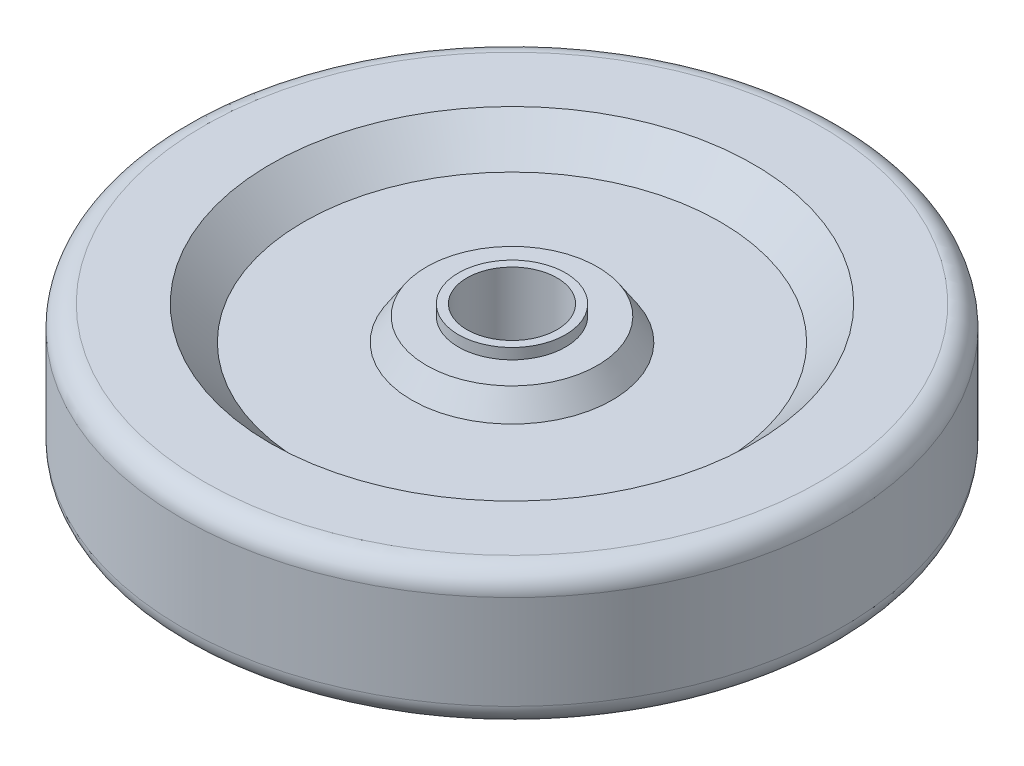
ISO-10303-21;
HEADER;
FILE_DESCRIPTION(('STEP AP214'),'2;1');
FILE_NAME('part.step','',(''),(''),'','','');
FILE_SCHEMA(('AUTOMOTIVE_DESIGN { 1 0 10303 214 1 1 1 1 }'));
ENDSEC;
DATA;
#1=APPLICATION_CONTEXT('core data for automotive mechanical design processes');
#2=APPLICATION_PROTOCOL_DEFINITION('international standard','automotive_design',2000,#1);
#3=PRODUCT_CONTEXT('',#1,'mechanical');
#4=PRODUCT('Part','Part','',(#3));
#5=PRODUCT_RELATED_PRODUCT_CATEGORY('part','',(#4));
#6=PRODUCT_DEFINITION_FORMATION('','',#4);
#7=PRODUCT_DEFINITION_CONTEXT('part definition',#1,'design');
#8=PRODUCT_DEFINITION('design','',#6,#7);
#9=PRODUCT_DEFINITION_SHAPE('','',#8);
#10=(LENGTH_UNIT() NAMED_UNIT(*) SI_UNIT(.MILLI.,.METRE.));
#11=(NAMED_UNIT(*) PLANE_ANGLE_UNIT() SI_UNIT($,.RADIAN.));
#12=(NAMED_UNIT(*) SI_UNIT($,.STERADIAN.) SOLID_ANGLE_UNIT());
#13=UNCERTAINTY_MEASURE_WITH_UNIT(LENGTH_MEASURE(1.E-05),#10,'distance_accuracy_value','');
#14=(GEOMETRIC_REPRESENTATION_CONTEXT(3) GLOBAL_UNCERTAINTY_ASSIGNED_CONTEXT((#13)) GLOBAL_UNIT_ASSIGNED_CONTEXT((#10,
#11,#12)) REPRESENTATION_CONTEXT('',''));
#15=CARTESIAN_POINT('',(0.,0.,0.));
#16=DIRECTION('',(0.,0.,1.));
#17=DIRECTION('',(1.,0.,0.));
#18=AXIS2_PLACEMENT_3D('',#15,#16,#17);
#19=CARTESIAN_POINT('',(0.,0.,-12.5));
#20=DIRECTION('',(0.,1.,0.));
#21=DIRECTION('',(0.,0.,1.));
#22=AXIS2_PLACEMENT_3D('',#19,#20,#21);
#23=PLANE('',#22);
#24=CARTESIAN_POINT('',(0.,0.,0.));
#25=DIRECTION('',(0.,1.,0.));
#26=DIRECTION('',(0.,0.,1.));
#27=AXIS2_PLACEMENT_3D('',#24,#25,#26);
#28=CIRCLE('',#27,12.5);
#29=CARTESIAN_POINT('',(0.,0.,12.5));
#30=VERTEX_POINT('',#29);
#31=EDGE_CURVE('E92',#30,#30,#28,.T.);
#32=ORIENTED_EDGE('',*,*,#31,.F.);
#33=EDGE_LOOP('',(#32));
#34=FACE_BOUND('',#33,.T.);
#35=CARTESIAN_POINT('',(0.,0.,0.));
#36=DIRECTION('',(0.,1.,0.));
#37=DIRECTION('',(0.,0.,1.));
#38=AXIS2_PLACEMENT_3D('',#35,#36,#37);
#39=CIRCLE('',#38,10.5);
#40=CARTESIAN_POINT('',(0.,0.,10.5));
#41=VERTEX_POINT('',#40);
#42=EDGE_CURVE('E10',#41,#41,#39,.T.);
#43=ORIENTED_EDGE('',*,*,#42,.T.);
#44=EDGE_LOOP('',(#43));
#45=FACE_BOUND('',#44,.T.);
#46=ADVANCED_FACE('F34',(#34,#45),#23,.F.);
#47=CARTESIAN_POINT('',(0.,76.5841864465714,0.));
#48=DIRECTION('',(0.,1.,0.));
#49=DIRECTION('',(0.,0.,1.));
#50=AXIS2_PLACEMENT_3D('',#47,#48,#49);
#51=CYLINDRICAL_SURFACE('',#50,10.5);
#52=ORIENTED_EDGE('',*,*,#42,.F.);
#53=EDGE_LOOP('',(#52));
#54=FACE_BOUND('',#53,.T.);
#55=CARTESIAN_POINT('',(0.,32.,0.));
#56=DIRECTION('',(0.,1.,0.));
#57=DIRECTION('',(0.,0.,1.));
#58=AXIS2_PLACEMENT_3D('',#55,#56,#57);
#59=CIRCLE('',#58,10.5);
#60=CARTESIAN_POINT('',(0.,32.,10.5));
#61=VERTEX_POINT('',#60);
#62=EDGE_CURVE('E40',#61,#61,#59,.T.);
#63=ORIENTED_EDGE('',*,*,#62,.T.);
#64=EDGE_LOOP('',(#63));
#65=FACE_BOUND('',#64,.T.);
#66=ADVANCED_FACE('F99',(#54,#65),#51,.F.);
#67=CARTESIAN_POINT('',(0.,32.,-10.5));
#68=DIRECTION('',(0.,-1.,0.));
#69=DIRECTION('',(0.,0.,-1.));
#70=AXIS2_PLACEMENT_3D('',#67,#68,#69);
#71=PLANE('',#70);
#72=ORIENTED_EDGE('',*,*,#62,.F.);
#73=EDGE_LOOP('',(#72));
#74=FACE_BOUND('',#73,.T.);
#75=CARTESIAN_POINT('',(0.,32.,0.));
#76=DIRECTION('',(0.,1.,0.));
#77=DIRECTION('',(0.,0.,1.));
#78=AXIS2_PLACEMENT_3D('',#75,#76,#77);
#79=CIRCLE('',#78,12.5);
#80=CARTESIAN_POINT('',(0.,32.,12.5));
#81=VERTEX_POINT('',#80);
#82=EDGE_CURVE('E44',#81,#81,#79,.T.);
#83=ORIENTED_EDGE('',*,*,#82,.T.);
#84=EDGE_LOOP('',(#83));
#85=FACE_BOUND('',#84,.T.);
#86=ADVANCED_FACE('F103',(#74,#85),#71,.F.);
#87=CARTESIAN_POINT('',(0.,76.5841864465714,0.));
#88=DIRECTION('',(0.,1.,0.));
#89=DIRECTION('',(0.,0.,1.));
#90=AXIS2_PLACEMENT_3D('',#87,#88,#89);
#91=CYLINDRICAL_SURFACE('',#90,12.5);
#92=ORIENTED_EDGE('',*,*,#82,.F.);
#93=EDGE_LOOP('',(#92));
#94=FACE_BOUND('',#93,.T.);
#95=CARTESIAN_POINT('',(0.,29.5,0.));
#96=DIRECTION('',(0.,1.,0.));
#97=DIRECTION('',(0.,0.,1.));
#98=AXIS2_PLACEMENT_3D('',#95,#96,#97);
#99=CIRCLE('',#98,12.5);
#100=CARTESIAN_POINT('',(0.,29.5,12.5));
#101=VERTEX_POINT('',#100);
#102=EDGE_CURVE('E48',#101,#101,#99,.T.);
#103=ORIENTED_EDGE('',*,*,#102,.T.);
#104=EDGE_LOOP('',(#103));
#105=FACE_BOUND('',#104,.T.);
#106=ADVANCED_FACE('F108',(#94,#105),#91,.T.);
#107=CARTESIAN_POINT('',(0.,29.5,-12.5));
#108=DIRECTION('',(0.,-1.,0.));
#109=DIRECTION('',(0.,0.,-1.));
#110=AXIS2_PLACEMENT_3D('',#107,#108,#109);
#111=PLANE('',#110);
#112=ORIENTED_EDGE('',*,*,#102,.F.);
#113=EDGE_LOOP('',(#112));
#114=FACE_BOUND('',#113,.T.);
#115=CARTESIAN_POINT('',(0.,29.5,0.));
#116=DIRECTION('',(0.,1.,0.));
#117=DIRECTION('',(0.,0.,1.));
#118=AXIS2_PLACEMENT_3D('',#115,#116,#117);
#119=CIRCLE('',#118,19.9443443288264);
#120=CARTESIAN_POINT('',(0.,29.5,19.9443443288264));
#121=VERTEX_POINT('',#120);
#122=EDGE_CURVE('E53',#121,#121,#119,.T.);
#123=ORIENTED_EDGE('',*,*,#122,.T.);
#124=EDGE_LOOP('',(#123));
#125=FACE_BOUND('',#124,.T.);
#126=ADVANCED_FACE('F114',(#114,#125),#111,.F.);
#127=CARTESIAN_POINT('',(0.,24.236876385354,0.));
#128=DIRECTION('',(0.,-1.,0.));
#129=DIRECTION('',(0.,0.,-1.));
#130=AXIS2_PLACEMENT_3D('',#127,#128,#129);
#131=CONICAL_SURFACE('',#130,23.412925951231,0.58270037698044);
#132=ORIENTED_EDGE('',*,*,#122,.F.);
#133=EDGE_LOOP('',(#132));
#134=FACE_BOUND('',#133,.T.);
#135=CARTESIAN_POINT('',(0.,24.236876385354,0.));
#136=DIRECTION('',(0.,1.,0.));
#137=DIRECTION('',(0.,0.,1.));
#138=AXIS2_PLACEMENT_3D('',#135,#136,#137);
#139=CIRCLE('',#138,23.412925951231);
#140=CARTESIAN_POINT('',(0.,24.236876385354,23.412925951231));
#141=VERTEX_POINT('',#140);
#142=EDGE_CURVE('E56',#141,#141,#139,.T.);
#143=ORIENTED_EDGE('',*,*,#142,.T.);
#144=EDGE_LOOP('',(#143));
#145=FACE_BOUND('',#144,.T.);
#146=ADVANCED_FACE('F118',(#134,#145),#131,.T.);
#147=CARTESIAN_POINT('',(0.,24.236876385354,-23.412925951231));
#148=DIRECTION('',(0.,-1.,0.));
#149=DIRECTION('',(0.,0.,-1.));
#150=AXIS2_PLACEMENT_3D('',#147,#148,#149);
#151=PLANE('',#150);
#152=ORIENTED_EDGE('',*,*,#142,.F.);
#153=EDGE_LOOP('',(#152));
#154=FACE_BOUND('',#153,.T.);
#155=CARTESIAN_POINT('',(0.,24.236876385354,0.));
#156=DIRECTION('',(0.,1.,0.));
#157=DIRECTION('',(0.,0.,1.));
#158=AXIS2_PLACEMENT_3D('',#155,#156,#157);
#159=CIRCLE('',#158,48.6268462064028);
#160=CARTESIAN_POINT('',(0.,24.236876385354,48.6268462064028));
#161=VERTEX_POINT('',#160);
#162=EDGE_CURVE('E59',#161,#161,#159,.T.);
#163=ORIENTED_EDGE('',*,*,#162,.T.);
#164=EDGE_LOOP('',(#163));
#165=FACE_BOUND('',#164,.T.);
#166=ADVANCED_FACE('F122',(#154,#165),#151,.F.);
#167=CARTESIAN_POINT('',(0.,32.,0.));
#168=DIRECTION('',(0.,1.,0.));
#169=DIRECTION('',(0.,0.,1.));
#170=AXIS2_PLACEMENT_3D('',#167,#168,#169);
#171=CONICAL_SURFACE('',#170,56.3899698210487,0.785398163397447);
#172=ORIENTED_EDGE('',*,*,#162,.F.);
#173=EDGE_LOOP('',(#172));
#174=FACE_BOUND('',#173,.T.);
#175=CARTESIAN_POINT('',(0.,32.,0.));
#176=DIRECTION('',(0.,1.,0.));
#177=DIRECTION('',(0.,0.,1.));
#178=AXIS2_PLACEMENT_3D('',#175,#176,#177);
#179=CIRCLE('',#178,56.3899698210487);
#180=CARTESIAN_POINT('',(0.,32.,56.3899698210487));
#181=VERTEX_POINT('',#180);
#182=EDGE_CURVE('E62',#181,#181,#179,.T.);
#183=ORIENTED_EDGE('',*,*,#182,.T.);
#184=EDGE_LOOP('',(#183));
#185=FACE_BOUND('',#184,.T.);
#186=ADVANCED_FACE('F126',(#174,#185),#171,.F.);
#187=CARTESIAN_POINT('',(0.,32.,-56.3899698210487));
#188=DIRECTION('',(0.,-1.,0.));
#189=DIRECTION('',(0.,0.,-1.));
#190=AXIS2_PLACEMENT_3D('',#187,#188,#189);
#191=PLANE('',#190);
#192=ORIENTED_EDGE('',*,*,#182,.F.);
#193=EDGE_LOOP('',(#192));
#194=FACE_BOUND('',#193,.T.);
#195=CARTESIAN_POINT('',(0.,32.,0.));
#196=DIRECTION('',(0.,1.,0.));
#197=DIRECTION('',(0.,0.,1.));
#198=AXIS2_PLACEMENT_3D('',#195,#196,#197);
#199=CIRCLE('',#198,71.9091271275478);
#200=CARTESIAN_POINT('',(0.,32.,71.9091271275478));
#201=VERTEX_POINT('',#200);
#202=EDGE_CURVE('E65',#201,#201,#199,.T.);
#203=ORIENTED_EDGE('',*,*,#202,.T.);
#204=EDGE_LOOP('',(#203));
#205=FACE_BOUND('',#204,.T.);
#206=ADVANCED_FACE('F130',(#194,#205),#191,.F.);
#207=CARTESIAN_POINT('',(0.,27.,0.));
#208=DIRECTION('',(0.,1.,0.));
#209=DIRECTION('',(0.,0.,1.));
#210=AXIS2_PLACEMENT_3D('',#207,#208,#209);
#211=TOROIDAL_SURFACE('',#210,71.9091271275478,5.);
#212=ORIENTED_EDGE('',*,*,#202,.F.);
#213=EDGE_LOOP('',(#212));
#214=FACE_BOUND('',#213,.T.);
#215=CARTESIAN_POINT('',(0.,27.,0.));
#216=DIRECTION('',(0.,1.,0.));
#217=DIRECTION('',(0.,0.,1.));
#218=AXIS2_PLACEMENT_3D('',#215,#216,#217);
#219=CIRCLE('',#218,76.9091271275479);
#220=CARTESIAN_POINT('',(0.,27.,76.9091271275479));
#221=VERTEX_POINT('',#220);
#222=EDGE_CURVE('E68',#221,#221,#219,.T.);
#223=ORIENTED_EDGE('',*,*,#222,.T.);
#224=EDGE_LOOP('',(#223));
#225=FACE_BOUND('',#224,.T.);
#226=ADVANCED_FACE('F134',(#214,#225),#211,.T.);
#227=CARTESIAN_POINT('',(0.,76.5841864465714,0.));
#228=DIRECTION('',(0.,1.,0.));
#229=DIRECTION('',(0.,0.,1.));
#230=AXIS2_PLACEMENT_3D('',#227,#228,#229);
#231=CYLINDRICAL_SURFACE('',#230,76.9091271275479);
#232=ORIENTED_EDGE('',*,*,#222,.F.);
#233=EDGE_LOOP('',(#232));
#234=FACE_BOUND('',#233,.T.);
#235=CARTESIAN_POINT('',(0.,5.00000000000003,0.));
#236=DIRECTION('',(0.,1.,0.));
#237=DIRECTION('',(0.,0.,1.));
#238=AXIS2_PLACEMENT_3D('',#235,#236,#237);
#239=CIRCLE('',#238,76.9091271275479);
#240=CARTESIAN_POINT('',(0.,5.00000000000003,76.9091271275479));
#241=VERTEX_POINT('',#240);
#242=EDGE_CURVE('E71',#241,#241,#239,.T.);
#243=ORIENTED_EDGE('',*,*,#242,.T.);
#244=EDGE_LOOP('',(#243));
#245=FACE_BOUND('',#244,.T.);
#246=ADVANCED_FACE('F138',(#234,#245),#231,.T.);
#247=CARTESIAN_POINT('',(0.,5.,0.));
#248=DIRECTION('',(0.,1.,0.));
#249=DIRECTION('',(0.,0.,1.));
#250=AXIS2_PLACEMENT_3D('',#247,#248,#249);
#251=TOROIDAL_SURFACE('',#250,71.9091271275478,5.);
#252=ORIENTED_EDGE('',*,*,#242,.F.);
#253=EDGE_LOOP('',(#252));
#254=FACE_BOUND('',#253,.T.);
#255=CARTESIAN_POINT('',(0.,0.,0.));
#256=DIRECTION('',(0.,1.,0.));
#257=DIRECTION('',(0.,0.,1.));
#258=AXIS2_PLACEMENT_3D('',#255,#256,#257);
#259=CIRCLE('',#258,71.9091271275478);
#260=CARTESIAN_POINT('',(0.,0.,71.9091271275478));
#261=VERTEX_POINT('',#260);
#262=EDGE_CURVE('E74',#261,#261,#259,.T.);
#263=ORIENTED_EDGE('',*,*,#262,.T.);
#264=EDGE_LOOP('',(#263));
#265=FACE_BOUND('',#264,.T.);
#266=ADVANCED_FACE('F142',(#254,#265),#251,.T.);
#267=CARTESIAN_POINT('',(0.,0.,-71.9091271275478));
#268=DIRECTION('',(0.,1.,0.));
#269=DIRECTION('',(0.,0.,1.));
#270=AXIS2_PLACEMENT_3D('',#267,#268,#269);
#271=PLANE('',#270);
#272=ORIENTED_EDGE('',*,*,#262,.F.);
#273=EDGE_LOOP('',(#272));
#274=FACE_BOUND('',#273,.T.);
#275=CARTESIAN_POINT('',(0.,0.,0.));
#276=DIRECTION('',(0.,1.,0.));
#277=DIRECTION('',(0.,0.,1.));
#278=AXIS2_PLACEMENT_3D('',#275,#276,#277);
#279=CIRCLE('',#278,56.3899698210487);
#280=CARTESIAN_POINT('',(0.,0.,56.3899698210487));
#281=VERTEX_POINT('',#280);
#282=EDGE_CURVE('E77',#281,#281,#279,.T.);
#283=ORIENTED_EDGE('',*,*,#282,.T.);
#284=EDGE_LOOP('',(#283));
#285=FACE_BOUND('',#284,.T.);
#286=ADVANCED_FACE('F146',(#274,#285),#271,.F.);
#287=CARTESIAN_POINT('',(0.,5.96858162240457,0.));
#288=DIRECTION('',(0.,-1.,0.));
#289=DIRECTION('',(0.,0.,-1.));
#290=AXIS2_PLACEMENT_3D('',#287,#288,#289);
#291=CONICAL_SURFACE('',#290,48.6438219933432,0.91428963850186);
#292=ORIENTED_EDGE('',*,*,#282,.F.);
#293=EDGE_LOOP('',(#292));
#294=FACE_BOUND('',#293,.T.);
#295=CARTESIAN_POINT('',(0.,5.96858162240457,0.));
#296=DIRECTION('',(0.,1.,0.));
#297=DIRECTION('',(0.,0.,1.));
#298=AXIS2_PLACEMENT_3D('',#295,#296,#297);
#299=CIRCLE('',#298,48.6438219933432);
#300=CARTESIAN_POINT('',(0.,5.96858162240457,48.6438219933432));
#301=VERTEX_POINT('',#300);
#302=EDGE_CURVE('E80',#301,#301,#299,.T.);
#303=ORIENTED_EDGE('',*,*,#302,.T.);
#304=EDGE_LOOP('',(#303));
#305=FACE_BOUND('',#304,.T.);
#306=ADVANCED_FACE('F150',(#294,#305),#291,.F.);
#307=CARTESIAN_POINT('',(0.,5.96858162240458,-23.412925951231));
#308=DIRECTION('',(0.,1.,0.));
#309=DIRECTION('',(0.,0.,1.));
#310=AXIS2_PLACEMENT_3D('',#307,#308,#309);
#311=PLANE('',#310);
#312=ORIENTED_EDGE('',*,*,#302,.F.);
#313=EDGE_LOOP('',(#312));
#314=FACE_BOUND('',#313,.T.);
#315=CARTESIAN_POINT('',(0.,5.96858162240459,0.));
#316=DIRECTION('',(0.,1.,0.));
#317=DIRECTION('',(0.,0.,1.));
#318=AXIS2_PLACEMENT_3D('',#315,#316,#317);
#319=CIRCLE('',#318,23.412925951231);
#320=CARTESIAN_POINT('',(0.,5.96858162240459,23.412925951231));
#321=VERTEX_POINT('',#320);
#322=EDGE_CURVE('E83',#321,#321,#319,.T.);
#323=ORIENTED_EDGE('',*,*,#322,.T.);
#324=EDGE_LOOP('',(#323));
#325=FACE_BOUND('',#324,.T.);
#326=ADVANCED_FACE('F154',(#314,#325),#311,.F.);
#327=CARTESIAN_POINT('',(0.,2.5,0.));
#328=DIRECTION('',(0.,1.,0.));
#329=DIRECTION('',(0.,0.,1.));
#330=AXIS2_PLACEMENT_3D('',#327,#328,#329);
#331=CONICAL_SURFACE('',#330,19.9443443288264,0.785398163397446);
#332=ORIENTED_EDGE('',*,*,#322,.F.);
#333=EDGE_LOOP('',(#332));
#334=FACE_BOUND('',#333,.T.);
#335=CARTESIAN_POINT('',(0.,2.5,0.));
#336=DIRECTION('',(0.,1.,0.));
#337=DIRECTION('',(0.,0.,1.));
#338=AXIS2_PLACEMENT_3D('',#335,#336,#337);
#339=CIRCLE('',#338,19.9443443288264);
#340=CARTESIAN_POINT('',(0.,2.5,19.9443443288264));
#341=VERTEX_POINT('',#340);
#342=EDGE_CURVE('E86',#341,#341,#339,.T.);
#343=ORIENTED_EDGE('',*,*,#342,.T.);
#344=EDGE_LOOP('',(#343));
#345=FACE_BOUND('',#344,.T.);
#346=ADVANCED_FACE('F158',(#334,#345),#331,.T.);
#347=CARTESIAN_POINT('',(0.,2.5,-12.5));
#348=DIRECTION('',(0.,1.,0.));
#349=DIRECTION('',(0.,0.,1.));
#350=AXIS2_PLACEMENT_3D('',#347,#348,#349);
#351=PLANE('',#350);
#352=ORIENTED_EDGE('',*,*,#342,.F.);
#353=EDGE_LOOP('',(#352));
#354=FACE_BOUND('',#353,.T.);
#355=CARTESIAN_POINT('',(0.,2.5,0.));
#356=DIRECTION('',(0.,1.,0.));
#357=DIRECTION('',(0.,0.,1.));
#358=AXIS2_PLACEMENT_3D('',#355,#356,#357);
#359=CIRCLE('',#358,12.5);
#360=CARTESIAN_POINT('',(0.,2.5,12.5));
#361=VERTEX_POINT('',#360);
#362=EDGE_CURVE('E89',#361,#361,#359,.T.);
#363=ORIENTED_EDGE('',*,*,#362,.T.);
#364=EDGE_LOOP('',(#363));
#365=FACE_BOUND('',#364,.T.);
#366=ADVANCED_FACE('F162',(#354,#365),#351,.F.);
#367=CARTESIAN_POINT('',(0.,76.5841864465714,0.));
#368=DIRECTION('',(0.,1.,0.));
#369=DIRECTION('',(0.,0.,1.));
#370=AXIS2_PLACEMENT_3D('',#367,#368,#369);
#371=CYLINDRICAL_SURFACE('',#370,12.5);
#372=ORIENTED_EDGE('',*,*,#362,.F.);
#373=EDGE_LOOP('',(#372));
#374=FACE_BOUND('',#373,.T.);
#375=ORIENTED_EDGE('',*,*,#31,.T.);
#376=EDGE_LOOP('',(#375));
#377=FACE_BOUND('',#376,.T.);
#378=ADVANCED_FACE('F96',(#374,#377),#371,.T.);
#379=CLOSED_SHELL('',(#46,#66,#86,#106,#126,#146,#166,#186,#206,#226,#246,#266,#286,#306,#326,
#346,#366,#378));
#380=MANIFOLD_SOLID_BREP('B2',#379);
#381=ADVANCED_BREP_SHAPE_REPRESENTATION('',(#18,#380),#14);
#382=SHAPE_DEFINITION_REPRESENTATION(#9,#381);
ENDSEC;
END-ISO-10303-21;
